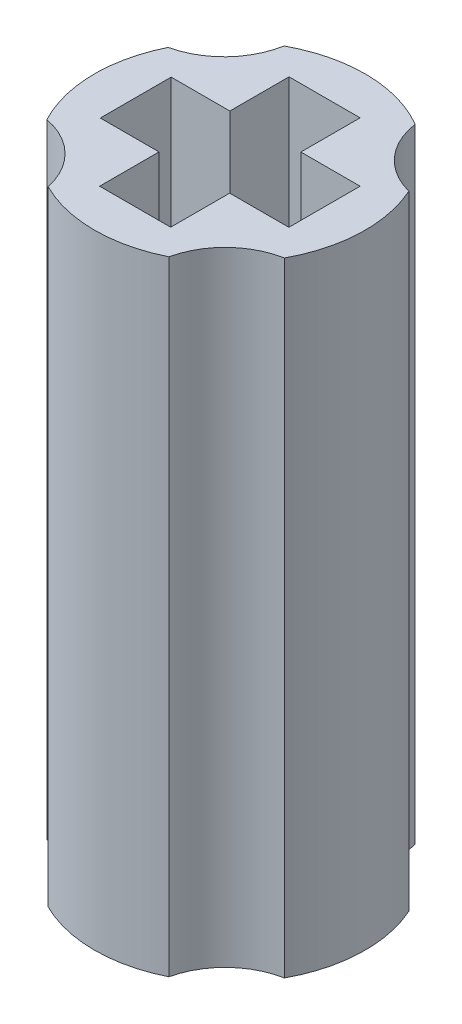
ISO-10303-21;
HEADER;
FILE_DESCRIPTION(('STEP AP214'),'2;1');
FILE_NAME('part.step','',(''),(''),'','','');
FILE_SCHEMA(('AUTOMOTIVE_DESIGN { 1 0 10303 214 1 1 1 1 }'));
ENDSEC;
DATA;
#1=APPLICATION_CONTEXT('core data for automotive mechanical design processes');
#2=APPLICATION_PROTOCOL_DEFINITION('international standard','automotive_design',2000,#1);
#3=PRODUCT_CONTEXT('',#1,'mechanical');
#4=PRODUCT('Part','Part','',(#3));
#5=PRODUCT_RELATED_PRODUCT_CATEGORY('part','',(#4));
#6=PRODUCT_DEFINITION_FORMATION('','',#4);
#7=PRODUCT_DEFINITION_CONTEXT('part definition',#1,'design');
#8=PRODUCT_DEFINITION('design','',#6,#7);
#9=PRODUCT_DEFINITION_SHAPE('','',#8);
#10=(LENGTH_UNIT() NAMED_UNIT(*) SI_UNIT(.MILLI.,.METRE.));
#11=(NAMED_UNIT(*) PLANE_ANGLE_UNIT() SI_UNIT($,.RADIAN.));
#12=(NAMED_UNIT(*) SI_UNIT($,.STERADIAN.) SOLID_ANGLE_UNIT());
#13=UNCERTAINTY_MEASURE_WITH_UNIT(LENGTH_MEASURE(1.E-05),#10,'distance_accuracy_value','');
#14=(GEOMETRIC_REPRESENTATION_CONTEXT(3) GLOBAL_UNCERTAINTY_ASSIGNED_CONTEXT((#13)) GLOBAL_UNIT_ASSIGNED_CONTEXT((#10,
#11,#12)) REPRESENTATION_CONTEXT('',''));
#15=CARTESIAN_POINT('',(0.,0.,0.));
#16=DIRECTION('',(0.,0.,1.));
#17=DIRECTION('',(1.,0.,0.));
#18=AXIS2_PLACEMENT_3D('',#15,#16,#17);
#19=CARTESIAN_POINT('',(1.79780312895783,15.8,-1.61268083564299));
#20=DIRECTION('',(0.,1.,0.));
#21=DIRECTION('',(0.,0.,1.));
#22=AXIS2_PLACEMENT_3D('',#19,#20,#21);
#23=PLANE('',#22);
#24=CARTESIAN_POINT('',(0.,15.8,0.));
#25=DIRECTION('',(0.,1.,0.));
#26=DIRECTION('',(0.,0.,1.));
#27=AXIS2_PLACEMENT_3D('',#24,#25,#26);
#28=CIRCLE('',#27,3.43);
#29=CARTESIAN_POINT('',(3.0161652687381,15.8,1.63329332076576));
#30=VERTEX_POINT('',#29);
#31=CARTESIAN_POINT('',(3.12787483160656,15.8,-1.40758624524476));
#32=VERTEX_POINT('',#31);
#33=EDGE_CURVE('E263',#30,#32,#28,.T.);
#34=ORIENTED_EDGE('',*,*,#33,.T.);
#35=CARTESIAN_POINT('',(3.59560625791565,15.8,-3.22536167128599));
#36=DIRECTION('',(0.,-1.,0.));
#37=DIRECTION('',(0.,0.,1.));
#38=AXIS2_PLACEMENT_3D('',#35,#36,#37);
#39=CIRCLE('',#38,1.87698699693858);
#40=CARTESIAN_POINT('',(1.73788290543117,15.8,-2.95713763748157));
#41=VERTEX_POINT('',#40);
#42=EDGE_CURVE('E266',#32,#41,#39,.T.);
#43=ORIENTED_EDGE('',*,*,#42,.T.);
#44=CARTESIAN_POINT('',(0.,15.8,0.));
#45=DIRECTION('',(0.,1.,0.));
#46=DIRECTION('',(0.,0.,1.));
#47=AXIS2_PLACEMENT_3D('',#44,#45,#46);
#48=CIRCLE('',#47,3.43);
#49=CARTESIAN_POINT('',(-1.64016665798051,15.8,-3.01243312524097));
#50=VERTEX_POINT('',#49);
#51=EDGE_CURVE('E269',#41,#50,#48,.T.);
#52=ORIENTED_EDGE('',*,*,#51,.T.);
#53=CARTESIAN_POINT('',(-3.48742710849046,15.8,-3.34516276723017));
#54=DIRECTION('',(0.,-1.,0.));
#55=DIRECTION('',(0.,0.,1.));
#56=AXIS2_PLACEMENT_3D('',#53,#54,#55);
#57=CIRCLE('',#56,1.87698699693858);
#58=CARTESIAN_POINT('',(-3.07809393960061,15.8,-1.5133531309625));
#59=VERTEX_POINT('',#58);
#60=EDGE_CURVE('E271',#50,#59,#57,.T.);
#61=ORIENTED_EDGE('',*,*,#60,.T.);
#62=CARTESIAN_POINT('',(0.,15.8,0.));
#63=DIRECTION('',(0.,1.,0.));
#64=DIRECTION('',(0.,0.,1.));
#65=AXIS2_PLACEMENT_3D('',#62,#63,#64);
#66=CIRCLE('',#65,3.43);
#67=CARTESIAN_POINT('',(-3.03051488244814,15.8,1.60651160819345));
#68=VERTEX_POINT('',#67);
#69=EDGE_CURVE('E273',#59,#68,#66,.T.);
#70=ORIENTED_EDGE('',*,*,#69,.T.);
#71=CARTESIAN_POINT('',(-3.37826835479625,15.8,3.4510027871223));
#72=DIRECTION('',(0.,-1.,0.));
#73=DIRECTION('',(0.,0.,1.));
#74=AXIS2_PLACEMENT_3D('',#71,#72,#73);
#75=CIRCLE('',#74,1.87698699693858);
#76=CARTESIAN_POINT('',(-1.54160215626995,15.8,3.06404353620895));
#77=VERTEX_POINT('',#76);
#78=EDGE_CURVE('E275',#68,#77,#75,.T.);
#79=ORIENTED_EDGE('',*,*,#78,.T.);
#80=CARTESIAN_POINT('',(0.,15.8,0.));
#81=DIRECTION('',(0.,1.,0.));
#82=DIRECTION('',(0.,0.,1.));
#83=AXIS2_PLACEMENT_3D('',#80,#81,#82);
#84=CIRCLE('',#83,3.43);
#85=CARTESIAN_POINT('',(1.52718605045412,15.8,3.07125426614248));
#86=VERTEX_POINT('',#85);
#87=EDGE_CURVE('E277',#77,#86,#84,.T.);
#88=ORIENTED_EDGE('',*,*,#87,.T.);
#89=CARTESIAN_POINT('',(3.35943320809886,15.8,3.47862453994662));
#90=DIRECTION('',(0.,-1.,0.));
#91=DIRECTION('',(0.,0.,1.));
#92=AXIS2_PLACEMENT_3D('',#89,#90,#91);
#93=CIRCLE('',#92,1.87698699693858);
#94=EDGE_CURVE('E279',#86,#30,#93,.T.);
#95=ORIENTED_EDGE('',*,*,#94,.T.);
#96=EDGE_LOOP('',(#34,#43,#52,#61,#70,#79,#88,#95));
#97=FACE_BOUND('',#96,.T.);
#98=DIRECTION('',(1.,0.,0.));
#99=VECTOR('',#98,1.);
#100=CARTESIAN_POINT('',(0.9,15.8,0.904758130262435));
#101=LINE('',#100,#99);
#102=CARTESIAN_POINT('',(0.9,15.8,0.904758130262435));
#103=VERTEX_POINT('',#102);
#104=CARTESIAN_POINT('',(2.4,15.8,0.904758130262435));
#105=VERTEX_POINT('',#104);
#106=EDGE_CURVE('E178',#103,#105,#101,.T.);
#107=ORIENTED_EDGE('',*,*,#106,.F.);
#108=DIRECTION('',(0.,0.,-1.));
#109=VECTOR('',#108,1.);
#110=CARTESIAN_POINT('',(0.9,15.8,0.904758130262435));
#111=LINE('',#110,#109);
#112=CARTESIAN_POINT('',(0.9,15.8,2.4));
#113=VERTEX_POINT('',#112);
#114=EDGE_CURVE('E170',#113,#103,#111,.T.);
#115=ORIENTED_EDGE('',*,*,#114,.F.);
#116=DIRECTION('',(1.,0.,0.));
#117=VECTOR('',#116,1.);
#118=CARTESIAN_POINT('',(-0.9,15.8,2.4));
#119=LINE('',#118,#117);
#120=CARTESIAN_POINT('',(-0.9,15.8,2.4));
#121=VERTEX_POINT('',#120);
#122=EDGE_CURVE('E211',#121,#113,#119,.T.);
#123=ORIENTED_EDGE('',*,*,#122,.F.);
#124=DIRECTION('',(0.,0.,1.));
#125=VECTOR('',#124,1.);
#126=CARTESIAN_POINT('',(-0.9,15.8,0.895266892782772));
#127=LINE('',#126,#125);
#128=CARTESIAN_POINT('',(-0.9,15.8,0.895266892782772));
#129=VERTEX_POINT('',#128);
#130=EDGE_CURVE('E209',#129,#121,#127,.T.);
#131=ORIENTED_EDGE('',*,*,#130,.F.);
#132=DIRECTION('',(1.,0.,0.));
#133=VECTOR('',#132,1.);
#134=CARTESIAN_POINT('',(-2.38737838075406,15.8,0.895266892782772));
#135=LINE('',#134,#133);
#136=CARTESIAN_POINT('',(-2.38737838075406,15.8,0.895266892782772));
#137=VERTEX_POINT('',#136);
#138=EDGE_CURVE('E207',#137,#129,#135,.T.);
#139=ORIENTED_EDGE('',*,*,#138,.F.);
#140=DIRECTION('',(0.,0.,1.));
#141=VECTOR('',#140,1.);
#142=CARTESIAN_POINT('',(-2.38737838075406,15.8,0.895266892782772));
#143=LINE('',#142,#141);
#144=CARTESIAN_POINT('',(-2.38737838075406,15.8,-0.9));
#145=VERTEX_POINT('',#144);
#146=EDGE_CURVE('E205',#145,#137,#143,.T.);
#147=ORIENTED_EDGE('',*,*,#146,.F.);
#148=DIRECTION('',(-1.,0.,0.));
#149=VECTOR('',#148,1.);
#150=CARTESIAN_POINT('',(-2.38737838075406,15.8,-0.9));
#151=LINE('',#150,#149);
#152=CARTESIAN_POINT('',(-0.9,15.8,-0.9));
#153=VERTEX_POINT('',#152);
#154=EDGE_CURVE('E203',#153,#145,#151,.T.);
#155=ORIENTED_EDGE('',*,*,#154,.F.);
#156=DIRECTION('',(0.,0.,1.));
#157=VECTOR('',#156,1.);
#158=CARTESIAN_POINT('',(-0.9,15.8,-2.4));
#159=LINE('',#158,#157);
#160=CARTESIAN_POINT('',(-0.9,15.8,-2.4));
#161=VERTEX_POINT('',#160);
#162=EDGE_CURVE('E201',#161,#153,#159,.T.);
#163=ORIENTED_EDGE('',*,*,#162,.F.);
#164=DIRECTION('',(-1.,0.,0.));
#165=VECTOR('',#164,1.);
#166=CARTESIAN_POINT('',(-0.9,15.8,-2.4));
#167=LINE('',#166,#165);
#168=CARTESIAN_POINT('',(0.9,15.8,-2.4));
#169=VERTEX_POINT('',#168);
#170=EDGE_CURVE('E199',#169,#161,#167,.T.);
#171=ORIENTED_EDGE('',*,*,#170,.F.);
#172=DIRECTION('',(0.,0.,-1.));
#173=VECTOR('',#172,1.);
#174=CARTESIAN_POINT('',(0.9,15.8,-2.4));
#175=LINE('',#174,#173);
#176=CARTESIAN_POINT('',(0.9,15.8,-0.9));
#177=VERTEX_POINT('',#176);
#178=EDGE_CURVE('E197',#177,#169,#175,.T.);
#179=ORIENTED_EDGE('',*,*,#178,.F.);
#180=DIRECTION('',(-1.,0.,0.));
#181=VECTOR('',#180,1.);
#182=CARTESIAN_POINT('',(0.9,15.8,-0.9));
#183=LINE('',#182,#181);
#184=CARTESIAN_POINT('',(2.4,15.8,-0.9));
#185=VERTEX_POINT('',#184);
#186=EDGE_CURVE('E193',#185,#177,#183,.T.);
#187=ORIENTED_EDGE('',*,*,#186,.F.);
#188=DIRECTION('',(0.,0.,-1.));
#189=VECTOR('',#188,1.);
#190=CARTESIAN_POINT('',(2.4,15.8,0.904758130262435));
#191=LINE('',#190,#189);
#192=EDGE_CURVE('E191',#105,#185,#191,.T.);
#193=ORIENTED_EDGE('',*,*,#192,.F.);
#194=EDGE_LOOP('',(#107,#115,#123,#131,#139,#147,#155,#163,#171,#179,#187,#193));
#195=FACE_BOUND('',#194,.T.);
#196=ADVANCED_FACE('F33',(#97,#195),#23,.T.);
#197=CARTESIAN_POINT('',(1.79780312895783,0.,-1.61268083564299));
#198=DIRECTION('',(0.,1.,0.));
#199=DIRECTION('',(0.,0.,1.));
#200=AXIS2_PLACEMENT_3D('',#197,#198,#199);
#201=PLANE('',#200);
#202=CARTESIAN_POINT('',(0.,0.,0.));
#203=DIRECTION('',(0.,1.,0.));
#204=DIRECTION('',(0.,0.,1.));
#205=AXIS2_PLACEMENT_3D('',#202,#203,#204);
#206=CIRCLE('',#205,3.43);
#207=CARTESIAN_POINT('',(3.0161652687381,0.,1.63329332076576));
#208=VERTEX_POINT('',#207);
#209=CARTESIAN_POINT('',(3.12787483160656,0.,-1.40758624524476));
#210=VERTEX_POINT('',#209);
#211=EDGE_CURVE('E186',#208,#210,#206,.T.);
#212=ORIENTED_EDGE('',*,*,#211,.F.);
#213=CARTESIAN_POINT('',(3.35943320809886,0.,3.47862453994662));
#214=DIRECTION('',(0.,-1.,0.));
#215=DIRECTION('',(0.,0.,1.));
#216=AXIS2_PLACEMENT_3D('',#213,#214,#215);
#217=CIRCLE('',#216,1.87698699693858);
#218=CARTESIAN_POINT('',(1.52718605045412,0.,3.07125426614248));
#219=VERTEX_POINT('',#218);
#220=EDGE_CURVE('E267',#219,#208,#217,.T.);
#221=ORIENTED_EDGE('',*,*,#220,.F.);
#222=CARTESIAN_POINT('',(0.,0.,0.));
#223=DIRECTION('',(0.,1.,0.));
#224=DIRECTION('',(0.,0.,1.));
#225=AXIS2_PLACEMENT_3D('',#222,#223,#224);
#226=CIRCLE('',#225,3.43);
#227=CARTESIAN_POINT('',(-1.54160215626995,0.,3.06404353620895));
#228=VERTEX_POINT('',#227);
#229=EDGE_CURVE('E294',#228,#219,#226,.T.);
#230=ORIENTED_EDGE('',*,*,#229,.F.);
#231=CARTESIAN_POINT('',(-3.37826835479625,0.,3.4510027871223));
#232=DIRECTION('',(0.,-1.,0.));
#233=DIRECTION('',(0.,0.,1.));
#234=AXIS2_PLACEMENT_3D('',#231,#232,#233);
#235=CIRCLE('',#234,1.87698699693858);
#236=CARTESIAN_POINT('',(-3.03051488244814,0.,1.60651160819345));
#237=VERTEX_POINT('',#236);
#238=EDGE_CURVE('E292',#237,#228,#235,.T.);
#239=ORIENTED_EDGE('',*,*,#238,.F.);
#240=CARTESIAN_POINT('',(0.,0.,0.));
#241=DIRECTION('',(0.,1.,0.));
#242=DIRECTION('',(0.,0.,1.));
#243=AXIS2_PLACEMENT_3D('',#240,#241,#242);
#244=CIRCLE('',#243,3.43);
#245=CARTESIAN_POINT('',(-3.07809393960061,0.,-1.5133531309625));
#246=VERTEX_POINT('',#245);
#247=EDGE_CURVE('E290',#246,#237,#244,.T.);
#248=ORIENTED_EDGE('',*,*,#247,.F.);
#249=CARTESIAN_POINT('',(-3.48742710849046,0.,-3.34516276723017));
#250=DIRECTION('',(0.,-1.,0.));
#251=DIRECTION('',(0.,0.,1.));
#252=AXIS2_PLACEMENT_3D('',#249,#250,#251);
#253=CIRCLE('',#252,1.87698699693858);
#254=CARTESIAN_POINT('',(-1.64016665798051,0.,-3.01243312524097));
#255=VERTEX_POINT('',#254);
#256=EDGE_CURVE('E288',#255,#246,#253,.T.);
#257=ORIENTED_EDGE('',*,*,#256,.F.);
#258=CARTESIAN_POINT('',(0.,0.,0.));
#259=DIRECTION('',(0.,1.,0.));
#260=DIRECTION('',(0.,0.,1.));
#261=AXIS2_PLACEMENT_3D('',#258,#259,#260);
#262=CIRCLE('',#261,3.43);
#263=CARTESIAN_POINT('',(1.73788290543117,0.,-2.95713763748157));
#264=VERTEX_POINT('',#263);
#265=EDGE_CURVE('E286',#264,#255,#262,.T.);
#266=ORIENTED_EDGE('',*,*,#265,.F.);
#267=CARTESIAN_POINT('',(3.59560625791565,0.,-3.22536167128599));
#268=DIRECTION('',(0.,-1.,0.));
#269=DIRECTION('',(0.,0.,1.));
#270=AXIS2_PLACEMENT_3D('',#267,#268,#269);
#271=CIRCLE('',#270,1.87698699693858);
#272=EDGE_CURVE('E284',#210,#264,#271,.T.);
#273=ORIENTED_EDGE('',*,*,#272,.F.);
#274=EDGE_LOOP('',(#212,#221,#230,#239,#248,#257,#266,#273));
#275=FACE_BOUND('',#274,.T.);
#276=DIRECTION('',(0.,0.,-1.));
#277=VECTOR('',#276,1.);
#278=CARTESIAN_POINT('',(0.9,0.,0.904758130262435));
#279=LINE('',#278,#277);
#280=CARTESIAN_POINT('',(0.9,0.,2.4));
#281=VERTEX_POINT('',#280);
#282=CARTESIAN_POINT('',(0.9,0.,0.904758130262435));
#283=VERTEX_POINT('',#282);
#284=EDGE_CURVE('E56',#281,#283,#279,.T.);
#285=ORIENTED_EDGE('',*,*,#284,.T.);
#286=DIRECTION('',(1.,0.,0.));
#287=VECTOR('',#286,1.);
#288=CARTESIAN_POINT('',(0.9,0.,0.904758130262435));
#289=LINE('',#288,#287);
#290=CARTESIAN_POINT('',(2.4,0.,0.904758130262435));
#291=VERTEX_POINT('',#290);
#292=EDGE_CURVE('E185',#283,#291,#289,.T.);
#293=ORIENTED_EDGE('',*,*,#292,.T.);
#294=DIRECTION('',(0.,0.,-1.));
#295=VECTOR('',#294,1.);
#296=CARTESIAN_POINT('',(2.4,0.,0.904758130262435));
#297=LINE('',#296,#295);
#298=CARTESIAN_POINT('',(2.4,0.,-0.9));
#299=VERTEX_POINT('',#298);
#300=EDGE_CURVE('E215',#291,#299,#297,.T.);
#301=ORIENTED_EDGE('',*,*,#300,.T.);
#302=DIRECTION('',(-1.,0.,0.));
#303=VECTOR('',#302,1.);
#304=CARTESIAN_POINT('',(0.9,0.,-0.9));
#305=LINE('',#304,#303);
#306=CARTESIAN_POINT('',(0.9,0.,-0.9));
#307=VERTEX_POINT('',#306);
#308=EDGE_CURVE('E218',#299,#307,#305,.T.);
#309=ORIENTED_EDGE('',*,*,#308,.T.);
#310=DIRECTION('',(0.,0.,-1.));
#311=VECTOR('',#310,1.);
#312=CARTESIAN_POINT('',(0.9,0.,-2.4));
#313=LINE('',#312,#311);
#314=CARTESIAN_POINT('',(0.9,0.,-2.4));
#315=VERTEX_POINT('',#314);
#316=EDGE_CURVE('E221',#307,#315,#313,.T.);
#317=ORIENTED_EDGE('',*,*,#316,.T.);
#318=DIRECTION('',(-1.,0.,0.));
#319=VECTOR('',#318,1.);
#320=CARTESIAN_POINT('',(-0.9,0.,-2.4));
#321=LINE('',#320,#319);
#322=CARTESIAN_POINT('',(-0.9,0.,-2.4));
#323=VERTEX_POINT('',#322);
#324=EDGE_CURVE('E224',#315,#323,#321,.T.);
#325=ORIENTED_EDGE('',*,*,#324,.T.);
#326=DIRECTION('',(0.,0.,1.));
#327=VECTOR('',#326,1.);
#328=CARTESIAN_POINT('',(-0.9,0.,-2.4));
#329=LINE('',#328,#327);
#330=CARTESIAN_POINT('',(-0.9,0.,-0.9));
#331=VERTEX_POINT('',#330);
#332=EDGE_CURVE('E227',#323,#331,#329,.T.);
#333=ORIENTED_EDGE('',*,*,#332,.T.);
#334=DIRECTION('',(-1.,0.,0.));
#335=VECTOR('',#334,1.);
#336=CARTESIAN_POINT('',(-2.38737838075406,0.,-0.9));
#337=LINE('',#336,#335);
#338=CARTESIAN_POINT('',(-2.38737838075406,0.,-0.9));
#339=VERTEX_POINT('',#338);
#340=EDGE_CURVE('E230',#331,#339,#337,.T.);
#341=ORIENTED_EDGE('',*,*,#340,.T.);
#342=DIRECTION('',(0.,0.,1.));
#343=VECTOR('',#342,1.);
#344=CARTESIAN_POINT('',(-2.38737838075406,0.,0.895266892782772));
#345=LINE('',#344,#343);
#346=CARTESIAN_POINT('',(-2.38737838075406,0.,0.895266892782772));
#347=VERTEX_POINT('',#346);
#348=EDGE_CURVE('E233',#339,#347,#345,.T.);
#349=ORIENTED_EDGE('',*,*,#348,.T.);
#350=DIRECTION('',(1.,0.,0.));
#351=VECTOR('',#350,1.);
#352=CARTESIAN_POINT('',(-2.38737838075406,0.,0.895266892782772));
#353=LINE('',#352,#351);
#354=CARTESIAN_POINT('',(-0.9,0.,0.895266892782772));
#355=VERTEX_POINT('',#354);
#356=EDGE_CURVE('E236',#347,#355,#353,.T.);
#357=ORIENTED_EDGE('',*,*,#356,.T.);
#358=DIRECTION('',(0.,0.,1.));
#359=VECTOR('',#358,1.);
#360=CARTESIAN_POINT('',(-0.9,0.,0.895266892782772));
#361=LINE('',#360,#359);
#362=CARTESIAN_POINT('',(-0.9,0.,2.4));
#363=VERTEX_POINT('',#362);
#364=EDGE_CURVE('E239',#355,#363,#361,.T.);
#365=ORIENTED_EDGE('',*,*,#364,.T.);
#366=DIRECTION('',(1.,0.,0.));
#367=VECTOR('',#366,1.);
#368=CARTESIAN_POINT('',(-0.9,0.,2.4));
#369=LINE('',#368,#367);
#370=EDGE_CURVE('E179',#363,#281,#369,.T.);
#371=ORIENTED_EDGE('',*,*,#370,.T.);
#372=EDGE_LOOP('',(#285,#293,#301,#309,#317,#325,#333,#341,#349,#357,#365,#371));
#373=FACE_BOUND('',#372,.T.);
#374=ADVANCED_FACE('F324',(#275,#373),#201,.F.);
#375=CARTESIAN_POINT('',(0.,15.8,0.));
#376=DIRECTION('',(0.,-1.,0.));
#377=DIRECTION('',(0.,0.,-1.));
#378=AXIS2_PLACEMENT_3D('',#375,#376,#377);
#379=CYLINDRICAL_SURFACE('',#378,3.43);
#380=ORIENTED_EDGE('',*,*,#211,.T.);
#381=DIRECTION('',(0.,-1.,0.));
#382=VECTOR('',#381,1.);
#383=CARTESIAN_POINT('',(3.12787483160656,15.8,-1.40758624524476));
#384=LINE('',#383,#382);
#385=EDGE_CURVE('E11',#32,#210,#384,.T.);
#386=ORIENTED_EDGE('',*,*,#385,.F.);
#387=ORIENTED_EDGE('',*,*,#33,.F.);
#388=DIRECTION('',(0.,-1.,0.));
#389=VECTOR('',#388,1.);
#390=CARTESIAN_POINT('',(3.0161652687381,15.8,1.63329332076576));
#391=LINE('',#390,#389);
#392=EDGE_CURVE('E281',#30,#208,#391,.T.);
#393=ORIENTED_EDGE('',*,*,#392,.T.);
#394=EDGE_LOOP('',(#380,#386,#387,#393));
#395=FACE_BOUND('',#394,.T.);
#396=ADVANCED_FACE('F35',(#395),#379,.T.);
#397=CARTESIAN_POINT('',(3.59560625791565,15.8,-3.22536167128599));
#398=DIRECTION('',(0.,-1.,0.));
#399=DIRECTION('',(0.,0.,-1.));
#400=AXIS2_PLACEMENT_3D('',#397,#398,#399);
#401=CYLINDRICAL_SURFACE('',#400,1.87698699693858);
#402=ORIENTED_EDGE('',*,*,#272,.T.);
#403=DIRECTION('',(0.,-1.,0.));
#404=VECTOR('',#403,1.);
#405=CARTESIAN_POINT('',(1.73788290543117,15.8,-2.95713763748157));
#406=LINE('',#405,#404);
#407=EDGE_CURVE('E41',#41,#264,#406,.T.);
#408=ORIENTED_EDGE('',*,*,#407,.F.);
#409=ORIENTED_EDGE('',*,*,#42,.F.);
#410=ORIENTED_EDGE('',*,*,#385,.T.);
#411=EDGE_LOOP('',(#402,#408,#409,#410));
#412=FACE_BOUND('',#411,.T.);
#413=ADVANCED_FACE('F341',(#412),#401,.F.);
#414=CARTESIAN_POINT('',(0.,15.8,0.));
#415=DIRECTION('',(0.,-1.,0.));
#416=DIRECTION('',(0.,0.,-1.));
#417=AXIS2_PLACEMENT_3D('',#414,#415,#416);
#418=CYLINDRICAL_SURFACE('',#417,3.43);
#419=ORIENTED_EDGE('',*,*,#265,.T.);
#420=DIRECTION('',(0.,-1.,0.));
#421=VECTOR('',#420,1.);
#422=CARTESIAN_POINT('',(-1.64016665798051,15.8,-3.01243312524097));
#423=LINE('',#422,#421);
#424=EDGE_CURVE('E311',#50,#255,#423,.T.);
#425=ORIENTED_EDGE('',*,*,#424,.F.);
#426=ORIENTED_EDGE('',*,*,#51,.F.);
#427=ORIENTED_EDGE('',*,*,#407,.T.);
#428=EDGE_LOOP('',(#419,#425,#426,#427));
#429=FACE_BOUND('',#428,.T.);
#430=ADVANCED_FACE('F318',(#429),#418,.T.);
#431=CARTESIAN_POINT('',(-3.48742710849046,15.8,-3.34516276723017));
#432=DIRECTION('',(0.,-1.,0.));
#433=DIRECTION('',(0.,0.,-1.));
#434=AXIS2_PLACEMENT_3D('',#431,#432,#433);
#435=CYLINDRICAL_SURFACE('',#434,1.87698699693858);
#436=ORIENTED_EDGE('',*,*,#256,.T.);
#437=DIRECTION('',(0.,-1.,0.));
#438=VECTOR('',#437,1.);
#439=CARTESIAN_POINT('',(-3.07809393960061,15.8,-1.5133531309625));
#440=LINE('',#439,#438);
#441=EDGE_CURVE('E308',#59,#246,#440,.T.);
#442=ORIENTED_EDGE('',*,*,#441,.F.);
#443=ORIENTED_EDGE('',*,*,#60,.F.);
#444=ORIENTED_EDGE('',*,*,#424,.T.);
#445=EDGE_LOOP('',(#436,#442,#443,#444));
#446=FACE_BOUND('',#445,.T.);
#447=ADVANCED_FACE('F330',(#446),#435,.F.);
#448=CARTESIAN_POINT('',(0.,15.8,0.));
#449=DIRECTION('',(0.,-1.,0.));
#450=DIRECTION('',(0.,0.,-1.));
#451=AXIS2_PLACEMENT_3D('',#448,#449,#450);
#452=CYLINDRICAL_SURFACE('',#451,3.43);
#453=ORIENTED_EDGE('',*,*,#247,.T.);
#454=DIRECTION('',(0.,-1.,0.));
#455=VECTOR('',#454,1.);
#456=CARTESIAN_POINT('',(-3.03051488244814,15.8,1.60651160819345));
#457=LINE('',#456,#455);
#458=EDGE_CURVE('E305',#68,#237,#457,.T.);
#459=ORIENTED_EDGE('',*,*,#458,.F.);
#460=ORIENTED_EDGE('',*,*,#69,.F.);
#461=ORIENTED_EDGE('',*,*,#441,.T.);
#462=EDGE_LOOP('',(#453,#459,#460,#461));
#463=FACE_BOUND('',#462,.T.);
#464=ADVANCED_FACE('F334',(#463),#452,.T.);
#465=CARTESIAN_POINT('',(-3.37826835479625,15.8,3.4510027871223));
#466=DIRECTION('',(0.,-1.,0.));
#467=DIRECTION('',(0.,0.,-1.));
#468=AXIS2_PLACEMENT_3D('',#465,#466,#467);
#469=CYLINDRICAL_SURFACE('',#468,1.87698699693858);
#470=ORIENTED_EDGE('',*,*,#238,.T.);
#471=DIRECTION('',(0.,-1.,0.));
#472=VECTOR('',#471,1.);
#473=CARTESIAN_POINT('',(-1.54160215626995,15.8,3.06404353620895));
#474=LINE('',#473,#472);
#475=EDGE_CURVE('E302',#77,#228,#474,.T.);
#476=ORIENTED_EDGE('',*,*,#475,.F.);
#477=ORIENTED_EDGE('',*,*,#78,.F.);
#478=ORIENTED_EDGE('',*,*,#458,.T.);
#479=EDGE_LOOP('',(#470,#476,#477,#478));
#480=FACE_BOUND('',#479,.T.);
#481=ADVANCED_FACE('F354',(#480),#469,.F.);
#482=CARTESIAN_POINT('',(0.,15.8,0.));
#483=DIRECTION('',(0.,-1.,0.));
#484=DIRECTION('',(0.,0.,-1.));
#485=AXIS2_PLACEMENT_3D('',#482,#483,#484);
#486=CYLINDRICAL_SURFACE('',#485,3.43);
#487=ORIENTED_EDGE('',*,*,#229,.T.);
#488=DIRECTION('',(0.,-1.,0.));
#489=VECTOR('',#488,1.);
#490=CARTESIAN_POINT('',(1.52718605045412,15.8,3.07125426614248));
#491=LINE('',#490,#489);
#492=EDGE_CURVE('E299',#86,#219,#491,.T.);
#493=ORIENTED_EDGE('',*,*,#492,.F.);
#494=ORIENTED_EDGE('',*,*,#87,.F.);
#495=ORIENTED_EDGE('',*,*,#475,.T.);
#496=EDGE_LOOP('',(#487,#493,#494,#495));
#497=FACE_BOUND('',#496,.T.);
#498=ADVANCED_FACE('F352',(#497),#486,.T.);
#499=CARTESIAN_POINT('',(3.35943320809886,15.8,3.47862453994662));
#500=DIRECTION('',(0.,-1.,0.));
#501=DIRECTION('',(0.,0.,-1.));
#502=AXIS2_PLACEMENT_3D('',#499,#500,#501);
#503=CYLINDRICAL_SURFACE('',#502,1.87698699693858);
#504=ORIENTED_EDGE('',*,*,#220,.T.);
#505=ORIENTED_EDGE('',*,*,#392,.F.);
#506=ORIENTED_EDGE('',*,*,#94,.F.);
#507=ORIENTED_EDGE('',*,*,#492,.T.);
#508=EDGE_LOOP('',(#504,#505,#506,#507));
#509=FACE_BOUND('',#508,.T.);
#510=ADVANCED_FACE('F347',(#509),#503,.F.);
#511=CARTESIAN_POINT('',(0.9,15.8,0.904758130262435));
#512=DIRECTION('',(-1.,0.,0.));
#513=DIRECTION('',(0.,0.,1.));
#514=AXIS2_PLACEMENT_3D('',#511,#512,#513);
#515=PLANE('',#514);
#516=ORIENTED_EDGE('',*,*,#284,.F.);
#517=DIRECTION('',(0.,-1.,0.));
#518=VECTOR('',#517,1.);
#519=CARTESIAN_POINT('',(0.9,15.8,2.4));
#520=LINE('',#519,#518);
#521=EDGE_CURVE('E174',#113,#281,#520,.T.);
#522=ORIENTED_EDGE('',*,*,#521,.F.);
#523=ORIENTED_EDGE('',*,*,#114,.T.);
#524=DIRECTION('',(0.,-1.,0.));
#525=VECTOR('',#524,1.);
#526=CARTESIAN_POINT('',(0.9,15.8,0.904758130262435));
#527=LINE('',#526,#525);
#528=EDGE_CURVE('E173',#103,#283,#527,.T.);
#529=ORIENTED_EDGE('',*,*,#528,.T.);
#530=EDGE_LOOP('',(#516,#522,#523,#529));
#531=FACE_BOUND('',#530,.T.);
#532=ADVANCED_FACE('F172',(#531),#515,.T.);
#533=CARTESIAN_POINT('',(0.9,15.8,0.904758130262435));
#534=DIRECTION('',(0.,0.,-1.));
#535=DIRECTION('',(-1.,0.,0.));
#536=AXIS2_PLACEMENT_3D('',#533,#534,#535);
#537=PLANE('',#536);
#538=ORIENTED_EDGE('',*,*,#292,.F.);
#539=ORIENTED_EDGE('',*,*,#528,.F.);
#540=ORIENTED_EDGE('',*,*,#106,.T.);
#541=DIRECTION('',(0.,-1.,0.));
#542=VECTOR('',#541,1.);
#543=CARTESIAN_POINT('',(2.4,15.8,0.904758130262435));
#544=LINE('',#543,#542);
#545=EDGE_CURVE('E187',#105,#291,#544,.T.);
#546=ORIENTED_EDGE('',*,*,#545,.T.);
#547=EDGE_LOOP('',(#538,#539,#540,#546));
#548=FACE_BOUND('',#547,.T.);
#549=ADVANCED_FACE('F182',(#548),#537,.T.);
#550=CARTESIAN_POINT('',(2.4,15.8,0.904758130262435));
#551=DIRECTION('',(-1.,0.,0.));
#552=DIRECTION('',(0.,0.,1.));
#553=AXIS2_PLACEMENT_3D('',#550,#551,#552);
#554=PLANE('',#553);
#555=ORIENTED_EDGE('',*,*,#300,.F.);
#556=ORIENTED_EDGE('',*,*,#545,.F.);
#557=ORIENTED_EDGE('',*,*,#192,.T.);
#558=DIRECTION('',(0.,-1.,0.));
#559=VECTOR('',#558,1.);
#560=CARTESIAN_POINT('',(2.4,15.8,-0.9));
#561=LINE('',#560,#559);
#562=EDGE_CURVE('E260',#185,#299,#561,.T.);
#563=ORIENTED_EDGE('',*,*,#562,.T.);
#564=EDGE_LOOP('',(#555,#556,#557,#563));
#565=FACE_BOUND('',#564,.T.);
#566=ADVANCED_FACE('F379',(#565),#554,.T.);
#567=CARTESIAN_POINT('',(0.9,15.8,-0.9));
#568=DIRECTION('',(0.,0.,1.));
#569=DIRECTION('',(1.,0.,0.));
#570=AXIS2_PLACEMENT_3D('',#567,#568,#569);
#571=PLANE('',#570);
#572=ORIENTED_EDGE('',*,*,#308,.F.);
#573=ORIENTED_EDGE('',*,*,#562,.F.);
#574=ORIENTED_EDGE('',*,*,#186,.T.);
#575=DIRECTION('',(0.,-1.,0.));
#576=VECTOR('',#575,1.);
#577=CARTESIAN_POINT('',(0.9,15.8,-0.9));
#578=LINE('',#577,#576);
#579=EDGE_CURVE('E258',#177,#307,#578,.T.);
#580=ORIENTED_EDGE('',*,*,#579,.T.);
#581=EDGE_LOOP('',(#572,#573,#574,#580));
#582=FACE_BOUND('',#581,.T.);
#583=ADVANCED_FACE('F383',(#582),#571,.T.);
#584=CARTESIAN_POINT('',(0.9,15.8,-2.4));
#585=DIRECTION('',(-1.,0.,0.));
#586=DIRECTION('',(0.,0.,1.));
#587=AXIS2_PLACEMENT_3D('',#584,#585,#586);
#588=PLANE('',#587);
#589=ORIENTED_EDGE('',*,*,#316,.F.);
#590=ORIENTED_EDGE('',*,*,#579,.F.);
#591=ORIENTED_EDGE('',*,*,#178,.T.);
#592=DIRECTION('',(0.,-1.,0.));
#593=VECTOR('',#592,1.);
#594=CARTESIAN_POINT('',(0.9,15.8,-2.4));
#595=LINE('',#594,#593);
#596=EDGE_CURVE('E256',#169,#315,#595,.T.);
#597=ORIENTED_EDGE('',*,*,#596,.T.);
#598=EDGE_LOOP('',(#589,#590,#591,#597));
#599=FACE_BOUND('',#598,.T.);
#600=ADVANCED_FACE('F389',(#599),#588,.T.);
#601=CARTESIAN_POINT('',(-0.9,15.8,-2.4));
#602=DIRECTION('',(0.,0.,1.));
#603=DIRECTION('',(1.,0.,0.));
#604=AXIS2_PLACEMENT_3D('',#601,#602,#603);
#605=PLANE('',#604);
#606=ORIENTED_EDGE('',*,*,#324,.F.);
#607=ORIENTED_EDGE('',*,*,#596,.F.);
#608=ORIENTED_EDGE('',*,*,#170,.T.);
#609=DIRECTION('',(0.,-1.,0.));
#610=VECTOR('',#609,1.);
#611=CARTESIAN_POINT('',(-0.9,15.8,-2.4));
#612=LINE('',#611,#610);
#613=EDGE_CURVE('E254',#161,#323,#612,.T.);
#614=ORIENTED_EDGE('',*,*,#613,.T.);
#615=EDGE_LOOP('',(#606,#607,#608,#614));
#616=FACE_BOUND('',#615,.T.);
#617=ADVANCED_FACE('F393',(#616),#605,.T.);
#618=CARTESIAN_POINT('',(-0.9,15.8,-2.4));
#619=DIRECTION('',(1.,0.,0.));
#620=DIRECTION('',(0.,0.,-1.));
#621=AXIS2_PLACEMENT_3D('',#618,#619,#620);
#622=PLANE('',#621);
#623=ORIENTED_EDGE('',*,*,#332,.F.);
#624=ORIENTED_EDGE('',*,*,#613,.F.);
#625=ORIENTED_EDGE('',*,*,#162,.T.);
#626=DIRECTION('',(0.,-1.,0.));
#627=VECTOR('',#626,1.);
#628=CARTESIAN_POINT('',(-0.9,15.8,-0.9));
#629=LINE('',#628,#627);
#630=EDGE_CURVE('E252',#153,#331,#629,.T.);
#631=ORIENTED_EDGE('',*,*,#630,.T.);
#632=EDGE_LOOP('',(#623,#624,#625,#631));
#633=FACE_BOUND('',#632,.T.);
#634=ADVANCED_FACE('F397',(#633),#622,.T.);
#635=CARTESIAN_POINT('',(-2.38737838075406,15.8,-0.9));
#636=DIRECTION('',(0.,0.,1.));
#637=DIRECTION('',(1.,0.,0.));
#638=AXIS2_PLACEMENT_3D('',#635,#636,#637);
#639=PLANE('',#638);
#640=ORIENTED_EDGE('',*,*,#340,.F.);
#641=ORIENTED_EDGE('',*,*,#630,.F.);
#642=ORIENTED_EDGE('',*,*,#154,.T.);
#643=DIRECTION('',(0.,-1.,0.));
#644=VECTOR('',#643,1.);
#645=CARTESIAN_POINT('',(-2.38737838075406,15.8,-0.9));
#646=LINE('',#645,#644);
#647=EDGE_CURVE('E250',#145,#339,#646,.T.);
#648=ORIENTED_EDGE('',*,*,#647,.T.);
#649=EDGE_LOOP('',(#640,#641,#642,#648));
#650=FACE_BOUND('',#649,.T.);
#651=ADVANCED_FACE('F401',(#650),#639,.T.);
#652=CARTESIAN_POINT('',(-2.38737838075406,15.8,0.895266892782772));
#653=DIRECTION('',(1.,0.,0.));
#654=DIRECTION('',(0.,0.,-1.));
#655=AXIS2_PLACEMENT_3D('',#652,#653,#654);
#656=PLANE('',#655);
#657=ORIENTED_EDGE('',*,*,#348,.F.);
#658=ORIENTED_EDGE('',*,*,#647,.F.);
#659=ORIENTED_EDGE('',*,*,#146,.T.);
#660=DIRECTION('',(0.,-1.,0.));
#661=VECTOR('',#660,1.);
#662=CARTESIAN_POINT('',(-2.38737838075406,15.8,0.895266892782772));
#663=LINE('',#662,#661);
#664=EDGE_CURVE('E248',#137,#347,#663,.T.);
#665=ORIENTED_EDGE('',*,*,#664,.T.);
#666=EDGE_LOOP('',(#657,#658,#659,#665));
#667=FACE_BOUND('',#666,.T.);
#668=ADVANCED_FACE('F405',(#667),#656,.T.);
#669=CARTESIAN_POINT('',(-2.38737838075406,15.8,0.895266892782772));
#670=DIRECTION('',(0.,0.,-1.));
#671=DIRECTION('',(-1.,0.,0.));
#672=AXIS2_PLACEMENT_3D('',#669,#670,#671);
#673=PLANE('',#672);
#674=ORIENTED_EDGE('',*,*,#356,.F.);
#675=ORIENTED_EDGE('',*,*,#664,.F.);
#676=ORIENTED_EDGE('',*,*,#138,.T.);
#677=DIRECTION('',(0.,-1.,0.));
#678=VECTOR('',#677,1.);
#679=CARTESIAN_POINT('',(-0.9,15.8,0.895266892782772));
#680=LINE('',#679,#678);
#681=EDGE_CURVE('E246',#129,#355,#680,.T.);
#682=ORIENTED_EDGE('',*,*,#681,.T.);
#683=EDGE_LOOP('',(#674,#675,#676,#682));
#684=FACE_BOUND('',#683,.T.);
#685=ADVANCED_FACE('F409',(#684),#673,.T.);
#686=CARTESIAN_POINT('',(-0.9,15.8,0.895266892782772));
#687=DIRECTION('',(1.,0.,0.));
#688=DIRECTION('',(0.,0.,-1.));
#689=AXIS2_PLACEMENT_3D('',#686,#687,#688);
#690=PLANE('',#689);
#691=ORIENTED_EDGE('',*,*,#364,.F.);
#692=ORIENTED_EDGE('',*,*,#681,.F.);
#693=ORIENTED_EDGE('',*,*,#130,.T.);
#694=DIRECTION('',(0.,-1.,0.));
#695=VECTOR('',#694,1.);
#696=CARTESIAN_POINT('',(-0.9,15.8,2.4));
#697=LINE('',#696,#695);
#698=EDGE_CURVE('E48',#121,#363,#697,.T.);
#699=ORIENTED_EDGE('',*,*,#698,.T.);
#700=EDGE_LOOP('',(#691,#692,#693,#699));
#701=FACE_BOUND('',#700,.T.);
#702=ADVANCED_FACE('F413',(#701),#690,.T.);
#703=CARTESIAN_POINT('',(-0.9,15.8,2.4));
#704=DIRECTION('',(0.,0.,-1.));
#705=DIRECTION('',(-1.,0.,0.));
#706=AXIS2_PLACEMENT_3D('',#703,#704,#705);
#707=PLANE('',#706);
#708=ORIENTED_EDGE('',*,*,#370,.F.);
#709=ORIENTED_EDGE('',*,*,#698,.F.);
#710=ORIENTED_EDGE('',*,*,#122,.T.);
#711=ORIENTED_EDGE('',*,*,#521,.T.);
#712=EDGE_LOOP('',(#708,#709,#710,#711));
#713=FACE_BOUND('',#712,.T.);
#714=ADVANCED_FACE('F417',(#713),#707,.T.);
#715=CLOSED_SHELL('',(#196,#374,#396,#413,#430,#447,#464,#481,#498,#510,#532,#549,#566,#583,
#600,#617,#634,#651,#668,#685,#702,#714));
#716=MANIFOLD_SOLID_BREP('B2',#715);
#717=ADVANCED_BREP_SHAPE_REPRESENTATION('',(#18,#716),#14);
#718=SHAPE_DEFINITION_REPRESENTATION(#9,#717);
ENDSEC;
END-ISO-10303-21;
